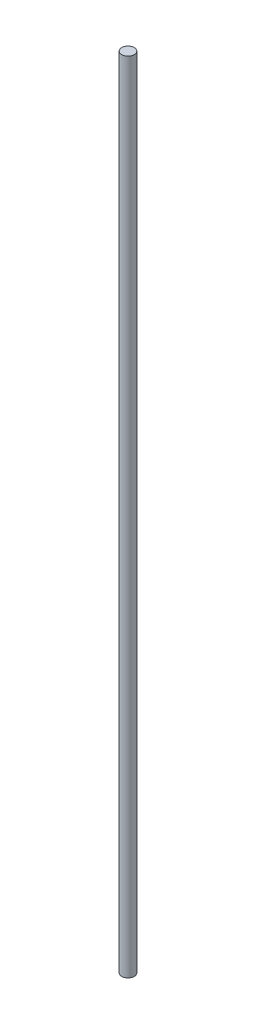
ISO-10303-21;
HEADER;
FILE_DESCRIPTION(('STEP AP214'),'2;1');
FILE_NAME('part.step','',(''),(''),'','','');
FILE_SCHEMA(('AUTOMOTIVE_DESIGN { 1 0 10303 214 1 1 1 1 }'));
ENDSEC;
DATA;
#1=APPLICATION_CONTEXT('core data for automotive mechanical design processes');
#2=APPLICATION_PROTOCOL_DEFINITION('international standard','automotive_design',2000,#1);
#3=PRODUCT_CONTEXT('',#1,'mechanical');
#4=PRODUCT('Part','Part','',(#3));
#5=PRODUCT_RELATED_PRODUCT_CATEGORY('part','',(#4));
#6=PRODUCT_DEFINITION_FORMATION('','',#4);
#7=PRODUCT_DEFINITION_CONTEXT('part definition',#1,'design');
#8=PRODUCT_DEFINITION('design','',#6,#7);
#9=PRODUCT_DEFINITION_SHAPE('','',#8);
#10=(LENGTH_UNIT() NAMED_UNIT(*) SI_UNIT(.MILLI.,.METRE.));
#11=(NAMED_UNIT(*) PLANE_ANGLE_UNIT() SI_UNIT($,.RADIAN.));
#12=(NAMED_UNIT(*) SI_UNIT($,.STERADIAN.) SOLID_ANGLE_UNIT());
#13=UNCERTAINTY_MEASURE_WITH_UNIT(LENGTH_MEASURE(1.E-05),#10,'distance_accuracy_value','');
#14=(GEOMETRIC_REPRESENTATION_CONTEXT(3) GLOBAL_UNCERTAINTY_ASSIGNED_CONTEXT((#13)) GLOBAL_UNIT_ASSIGNED_CONTEXT((#10,
#11,#12)) REPRESENTATION_CONTEXT('',''));
#15=CARTESIAN_POINT('',(0.,0.,0.));
#16=DIRECTION('',(0.,0.,1.));
#17=DIRECTION('',(1.,0.,0.));
#18=AXIS2_PLACEMENT_3D('',#15,#16,#17);
#19=CARTESIAN_POINT('',(0.,609.6,0.));
#20=DIRECTION('',(0.,1.,0.));
#21=DIRECTION('',(0.,0.,1.));
#22=AXIS2_PLACEMENT_3D('',#19,#20,#21);
#23=PLANE('',#22);
#24=CARTESIAN_POINT('',(0.,609.6,0.));
#25=DIRECTION('',(0.,1.,0.));
#26=DIRECTION('',(0.,0.,1.));
#27=AXIS2_PLACEMENT_3D('',#24,#25,#26);
#28=CIRCLE('',#27,4.7625);
#29=CARTESIAN_POINT('',(0.,609.6,4.7625));
#30=VERTEX_POINT('',#29);
#31=EDGE_CURVE('E17',#30,#30,#28,.F.);
#32=ORIENTED_EDGE('',*,*,#31,.F.);
#33=EDGE_LOOP('',(#32));
#34=FACE_BOUND('',#33,.T.);
#35=ADVANCED_FACE('F14',(#34),#23,.T.);
#36=CARTESIAN_POINT('',(0.,0.,0.));
#37=DIRECTION('',(0.,1.,0.));
#38=DIRECTION('',(0.,0.,1.));
#39=AXIS2_PLACEMENT_3D('',#36,#37,#38);
#40=PLANE('',#39);
#41=CARTESIAN_POINT('',(0.,0.,0.));
#42=DIRECTION('',(0.,1.,0.));
#43=DIRECTION('',(0.,0.,1.));
#44=AXIS2_PLACEMENT_3D('',#41,#42,#43);
#45=CIRCLE('',#44,4.7625);
#46=CARTESIAN_POINT('',(0.,0.,4.7625));
#47=VERTEX_POINT('',#46);
#48=EDGE_CURVE('E10',#47,#47,#45,.T.);
#49=ORIENTED_EDGE('',*,*,#48,.F.);
#50=EDGE_LOOP('',(#49));
#51=FACE_BOUND('',#50,.T.);
#52=ADVANCED_FACE('F29',(#51),#40,.F.);
#53=CARTESIAN_POINT('',(0.,0.,0.));
#54=DIRECTION('',(0.,1.,0.));
#55=DIRECTION('',(0.,0.,1.));
#56=AXIS2_PLACEMENT_3D('',#53,#54,#55);
#57=CYLINDRICAL_SURFACE('',#56,4.7625);
#58=ORIENTED_EDGE('',*,*,#48,.T.);
#59=EDGE_LOOP('',(#58));
#60=FACE_BOUND('',#59,.T.);
#61=ORIENTED_EDGE('',*,*,#31,.T.);
#62=EDGE_LOOP('',(#61));
#63=FACE_BOUND('',#62,.T.);
#64=ADVANCED_FACE('F26',(#60,#63),#57,.T.);
#65=CLOSED_SHELL('',(#35,#52,#64));
#66=MANIFOLD_SOLID_BREP('B1',#65);
#67=ADVANCED_BREP_SHAPE_REPRESENTATION('',(#18,#66),#14);
#68=SHAPE_DEFINITION_REPRESENTATION(#9,#67);
ENDSEC;
END-ISO-10303-21;
